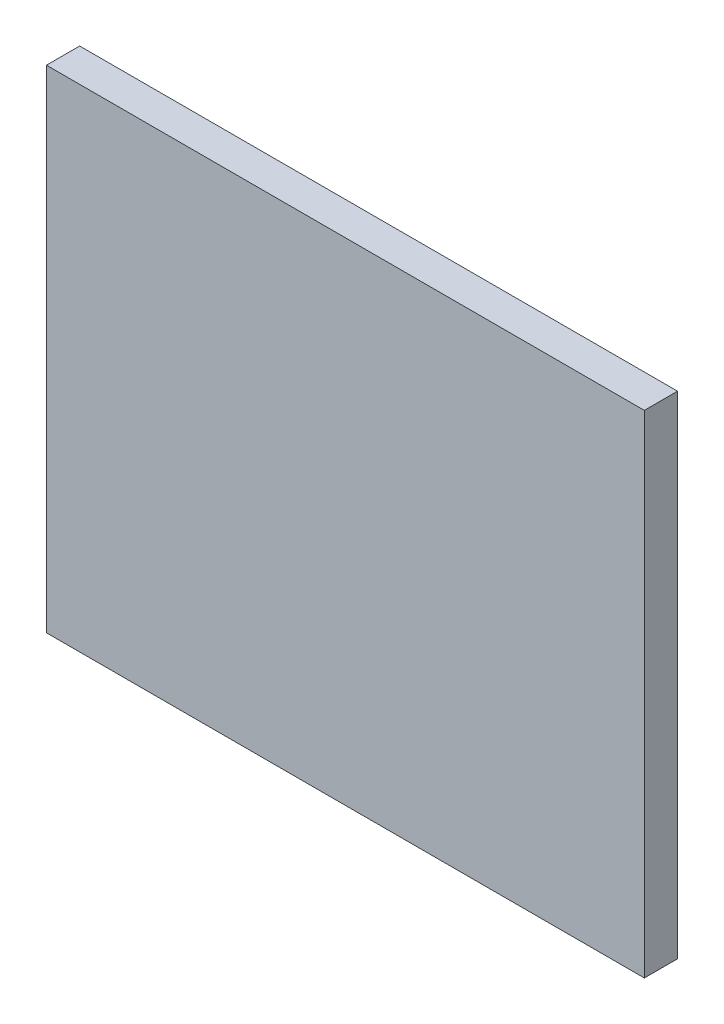
ISO-10303-21;
HEADER;
FILE_DESCRIPTION(('STEP AP214'),'2;1');
FILE_NAME('part.step','',(''),(''),'','','');
FILE_SCHEMA(('AUTOMOTIVE_DESIGN { 1 0 10303 214 1 1 1 1 }'));
ENDSEC;
DATA;
#1=APPLICATION_CONTEXT('core data for automotive mechanical design processes');
#2=APPLICATION_PROTOCOL_DEFINITION('international standard','automotive_design',2000,#1);
#3=PRODUCT_CONTEXT('',#1,'mechanical');
#4=PRODUCT('Part','Part','',(#3));
#5=PRODUCT_RELATED_PRODUCT_CATEGORY('part','',(#4));
#6=PRODUCT_DEFINITION_FORMATION('','',#4);
#7=PRODUCT_DEFINITION_CONTEXT('part definition',#1,'design');
#8=PRODUCT_DEFINITION('design','',#6,#7);
#9=PRODUCT_DEFINITION_SHAPE('','',#8);
#10=(LENGTH_UNIT() NAMED_UNIT(*) SI_UNIT(.MILLI.,.METRE.));
#11=(NAMED_UNIT(*) PLANE_ANGLE_UNIT() SI_UNIT($,.RADIAN.));
#12=(NAMED_UNIT(*) SI_UNIT($,.STERADIAN.) SOLID_ANGLE_UNIT());
#13=UNCERTAINTY_MEASURE_WITH_UNIT(LENGTH_MEASURE(1.E-05),#10,'distance_accuracy_value','');
#14=(GEOMETRIC_REPRESENTATION_CONTEXT(3) GLOBAL_UNCERTAINTY_ASSIGNED_CONTEXT((#13)) GLOBAL_UNIT_ASSIGNED_CONTEXT((#10,
#11,#12)) REPRESENTATION_CONTEXT('',''));
#15=CARTESIAN_POINT('',(0.,0.,0.));
#16=DIRECTION('',(0.,0.,1.));
#17=DIRECTION('',(1.,0.,0.));
#18=AXIS2_PLACEMENT_3D('',#15,#16,#17);
#19=CARTESIAN_POINT('',(0.,0.,0.));
#20=DIRECTION('',(0.,0.,-1.));
#21=DIRECTION('',(-1.,0.,0.));
#22=AXIS2_PLACEMENT_3D('',#19,#20,#21);
#23=PLANE('',#22);
#24=DIRECTION('',(0.,1.,0.));
#25=VECTOR('',#24,1.);
#26=CARTESIAN_POINT('',(45.,-37.,0.));
#27=LINE('',#26,#25);
#28=CARTESIAN_POINT('',(45.,-37.,0.));
#29=VERTEX_POINT('',#28);
#30=CARTESIAN_POINT('',(45.,37.,0.));
#31=VERTEX_POINT('',#30);
#32=EDGE_CURVE('E286',#29,#31,#27,.T.);
#33=ORIENTED_EDGE('',*,*,#32,.F.);
#34=DIRECTION('',(1.,0.,0.));
#35=VECTOR('',#34,1.);
#36=CARTESIAN_POINT('',(-45.,-37.,0.));
#37=LINE('',#36,#35);
#38=CARTESIAN_POINT('',(-45.,-37.,0.));
#39=VERTEX_POINT('',#38);
#40=EDGE_CURVE('E291',#39,#29,#37,.T.);
#41=ORIENTED_EDGE('',*,*,#40,.F.);
#42=DIRECTION('',(0.,-1.,0.));
#43=VECTOR('',#42,1.);
#44=CARTESIAN_POINT('',(-45.,-37.,0.));
#45=LINE('',#44,#43);
#46=CARTESIAN_POINT('',(-45.,37.,0.));
#47=VERTEX_POINT('',#46);
#48=EDGE_CURVE('E302',#47,#39,#45,.T.);
#49=ORIENTED_EDGE('',*,*,#48,.F.);
#50=DIRECTION('',(-1.,0.,0.));
#51=VECTOR('',#50,1.);
#52=CARTESIAN_POINT('',(-45.,37.,0.));
#53=LINE('',#52,#51);
#54=EDGE_CURVE('E300',#31,#47,#53,.T.);
#55=ORIENTED_EDGE('',*,*,#54,.F.);
#56=EDGE_LOOP('',(#33,#41,#49,#55));
#57=FACE_BOUND('',#56,.T.);
#58=DIRECTION('',(1.,0.,0.));
#59=VECTOR('',#58,1.);
#60=CARTESIAN_POINT('',(40.,32.5,0.));
#61=LINE('',#60,#59);
#62=CARTESIAN_POINT('',(10.,32.5,0.));
#63=VERTEX_POINT('',#62);
#64=CARTESIAN_POINT('',(40.,32.5,0.));
#65=VERTEX_POINT('',#64);
#66=EDGE_CURVE('E271',#63,#65,#61,.T.);
#67=ORIENTED_EDGE('',*,*,#66,.F.);
#68=DIRECTION('',(0.,1.,0.));
#69=VECTOR('',#68,1.);
#70=CARTESIAN_POINT('',(10.,32.5,0.));
#71=LINE('',#70,#69);
#72=CARTESIAN_POINT('',(10.,7.49999999999999,0.));
#73=VERTEX_POINT('',#72);
#74=EDGE_CURVE('E257',#73,#63,#71,.T.);
#75=ORIENTED_EDGE('',*,*,#74,.F.);
#76=DIRECTION('',(-1.,0.,0.));
#77=VECTOR('',#76,1.);
#78=CARTESIAN_POINT('',(40.,7.49999999999999,0.));
#79=LINE('',#78,#77);
#80=CARTESIAN_POINT('',(40.,7.49999999999999,0.));
#81=VERTEX_POINT('',#80);
#82=EDGE_CURVE('E262',#81,#73,#79,.T.);
#83=ORIENTED_EDGE('',*,*,#82,.F.);
#84=DIRECTION('',(0.,-1.,0.));
#85=VECTOR('',#84,1.);
#86=CARTESIAN_POINT('',(40.,32.5,0.));
#87=LINE('',#86,#85);
#88=EDGE_CURVE('E273',#65,#81,#87,.T.);
#89=ORIENTED_EDGE('',*,*,#88,.F.);
#90=EDGE_LOOP('',(#67,#75,#83,#89));
#91=FACE_BOUND('',#90,.T.);
#92=DIRECTION('',(-1.,0.,0.));
#93=VECTOR('',#92,1.);
#94=CARTESIAN_POINT('',(40.,-32.5,0.));
#95=LINE('',#94,#93);
#96=CARTESIAN_POINT('',(40.,-32.5,0.));
#97=VERTEX_POINT('',#96);
#98=CARTESIAN_POINT('',(10.,-32.5,0.));
#99=VERTEX_POINT('',#98);
#100=EDGE_CURVE('E242',#97,#99,#95,.T.);
#101=ORIENTED_EDGE('',*,*,#100,.F.);
#102=DIRECTION('',(0.,-1.,0.));
#103=VECTOR('',#102,1.);
#104=CARTESIAN_POINT('',(40.,-32.5,0.));
#105=LINE('',#104,#103);
#106=CARTESIAN_POINT('',(40.,-7.5,0.));
#107=VERTEX_POINT('',#106);
#108=EDGE_CURVE('E228',#107,#97,#105,.T.);
#109=ORIENTED_EDGE('',*,*,#108,.F.);
#110=DIRECTION('',(1.,0.,0.));
#111=VECTOR('',#110,1.);
#112=CARTESIAN_POINT('',(40.,-7.5,0.));
#113=LINE('',#112,#111);
#114=CARTESIAN_POINT('',(10.,-7.50000000000001,0.));
#115=VERTEX_POINT('',#114);
#116=EDGE_CURVE('E233',#115,#107,#113,.T.);
#117=ORIENTED_EDGE('',*,*,#116,.F.);
#118=DIRECTION('',(0.,1.,0.));
#119=VECTOR('',#118,1.);
#120=CARTESIAN_POINT('',(10.,-32.5,0.));
#121=LINE('',#120,#119);
#122=EDGE_CURVE('E244',#99,#115,#121,.T.);
#123=ORIENTED_EDGE('',*,*,#122,.F.);
#124=EDGE_LOOP('',(#101,#109,#117,#123));
#125=FACE_BOUND('',#124,.T.);
#126=DIRECTION('',(1.,0.,0.));
#127=VECTOR('',#126,1.);
#128=CARTESIAN_POINT('',(-40.,32.5,0.));
#129=LINE('',#128,#127);
#130=CARTESIAN_POINT('',(-40.,32.5,0.));
#131=VERTEX_POINT('',#130);
#132=CARTESIAN_POINT('',(-10.,32.5,0.));
#133=VERTEX_POINT('',#132);
#134=EDGE_CURVE('E200',#131,#133,#129,.T.);
#135=ORIENTED_EDGE('',*,*,#134,.F.);
#136=DIRECTION('',(0.,1.,0.));
#137=VECTOR('',#136,1.);
#138=CARTESIAN_POINT('',(-40.,32.5,0.));
#139=LINE('',#138,#137);
#140=CARTESIAN_POINT('',(-40.,7.50000000000002,0.));
#141=VERTEX_POINT('',#140);
#142=EDGE_CURVE('E197',#141,#131,#139,.T.);
#143=ORIENTED_EDGE('',*,*,#142,.F.);
#144=DIRECTION('',(-1.,0.,0.));
#145=VECTOR('',#144,1.);
#146=CARTESIAN_POINT('',(-40.,7.50000000000002,0.));
#147=LINE('',#146,#145);
#148=CARTESIAN_POINT('',(-10.,7.5,0.));
#149=VERTEX_POINT('',#148);
#150=EDGE_CURVE('E209',#149,#141,#147,.T.);
#151=ORIENTED_EDGE('',*,*,#150,.F.);
#152=DIRECTION('',(0.,-1.,0.));
#153=VECTOR('',#152,1.);
#154=CARTESIAN_POINT('',(-10.,32.5,0.));
#155=LINE('',#154,#153);
#156=EDGE_CURVE('E217',#133,#149,#155,.T.);
#157=ORIENTED_EDGE('',*,*,#156,.F.);
#158=EDGE_LOOP('',(#135,#143,#151,#157));
#159=FACE_BOUND('',#158,.T.);
#160=DIRECTION('',(0.,1.,0.));
#161=VECTOR('',#160,1.);
#162=CARTESIAN_POINT('',(-40.0000000000001,-32.5,0.));
#163=LINE('',#162,#161);
#164=CARTESIAN_POINT('',(-40.0000000000001,-32.5,0.));
#165=VERTEX_POINT('',#164);
#166=CARTESIAN_POINT('',(-40.,-7.49999999999997,0.));
#167=VERTEX_POINT('',#166);
#168=EDGE_CURVE('E576',#165,#167,#163,.T.);
#169=ORIENTED_EDGE('',*,*,#168,.F.);
#170=DIRECTION('',(-1.,0.,0.));
#171=VECTOR('',#170,1.);
#172=CARTESIAN_POINT('',(-40.0000000000001,-32.5,0.));
#173=LINE('',#172,#171);
#174=CARTESIAN_POINT('',(-10.0000000000001,-32.5,0.));
#175=VERTEX_POINT('',#174);
#176=EDGE_CURVE('E195',#175,#165,#173,.T.);
#177=ORIENTED_EDGE('',*,*,#176,.F.);
#178=DIRECTION('',(0.,-1.,0.));
#179=VECTOR('',#178,1.);
#180=CARTESIAN_POINT('',(-10.0000000000001,-32.5,0.));
#181=LINE('',#180,#179);
#182=CARTESIAN_POINT('',(-10.0000000000001,-7.49999999999999,0.));
#183=VERTEX_POINT('',#182);
#184=EDGE_CURVE('E191',#183,#175,#181,.T.);
#185=ORIENTED_EDGE('',*,*,#184,.F.);
#186=DIRECTION('',(1.,0.,0.));
#187=VECTOR('',#186,1.);
#188=CARTESIAN_POINT('',(-40.,-7.49999999999997,0.));
#189=LINE('',#188,#187);
#190=EDGE_CURVE('E573',#167,#183,#189,.T.);
#191=ORIENTED_EDGE('',*,*,#190,.F.);
#192=EDGE_LOOP('',(#169,#177,#185,#191));
#193=FACE_BOUND('',#192,.T.);
#194=ADVANCED_FACE('F34',(#57,#91,#125,#159,#193),#23,.T.);
#195=CARTESIAN_POINT('',(45.,-37.,5.));
#196=DIRECTION('',(-1.,0.,0.));
#197=DIRECTION('',(0.,0.,1.));
#198=AXIS2_PLACEMENT_3D('',#195,#196,#197);
#199=PLANE('',#198);
#200=ORIENTED_EDGE('',*,*,#32,.T.);
#201=DIRECTION('',(0.,0.,-1.));
#202=VECTOR('',#201,1.);
#203=CARTESIAN_POINT('',(45.,37.,5.));
#204=LINE('',#203,#202);
#205=CARTESIAN_POINT('',(45.,37.,5.));
#206=VERTEX_POINT('',#205);
#207=EDGE_CURVE('E11',#206,#31,#204,.T.);
#208=ORIENTED_EDGE('',*,*,#207,.F.);
#209=DIRECTION('',(0.,1.,0.));
#210=VECTOR('',#209,1.);
#211=CARTESIAN_POINT('',(45.,-37.,5.));
#212=LINE('',#211,#210);
#213=CARTESIAN_POINT('',(45.,-37.,5.));
#214=VERTEX_POINT('',#213);
#215=EDGE_CURVE('E287',#214,#206,#212,.T.);
#216=ORIENTED_EDGE('',*,*,#215,.F.);
#217=DIRECTION('',(0.,0.,-1.));
#218=VECTOR('',#217,1.);
#219=CARTESIAN_POINT('',(45.,-37.,5.));
#220=LINE('',#219,#218);
#221=EDGE_CURVE('E297',#214,#29,#220,.T.);
#222=ORIENTED_EDGE('',*,*,#221,.T.);
#223=EDGE_LOOP('',(#200,#208,#216,#222));
#224=FACE_BOUND('',#223,.T.);
#225=ADVANCED_FACE('F36',(#224),#199,.F.);
#226=CARTESIAN_POINT('',(-45.,37.,5.));
#227=DIRECTION('',(0.,-1.,0.));
#228=DIRECTION('',(0.,0.,-1.));
#229=AXIS2_PLACEMENT_3D('',#226,#227,#228);
#230=PLANE('',#229);
#231=ORIENTED_EDGE('',*,*,#54,.T.);
#232=DIRECTION('',(0.,0.,-1.));
#233=VECTOR('',#232,1.);
#234=CARTESIAN_POINT('',(-45.,37.,5.));
#235=LINE('',#234,#233);
#236=CARTESIAN_POINT('',(-45.,37.,5.));
#237=VERTEX_POINT('',#236);
#238=EDGE_CURVE('E42',#237,#47,#235,.T.);
#239=ORIENTED_EDGE('',*,*,#238,.F.);
#240=DIRECTION('',(-1.,0.,0.));
#241=VECTOR('',#240,1.);
#242=CARTESIAN_POINT('',(-45.,37.,5.));
#243=LINE('',#242,#241);
#244=EDGE_CURVE('E290',#206,#237,#243,.T.);
#245=ORIENTED_EDGE('',*,*,#244,.F.);
#246=ORIENTED_EDGE('',*,*,#207,.T.);
#247=EDGE_LOOP('',(#231,#239,#245,#246));
#248=FACE_BOUND('',#247,.T.);
#249=ADVANCED_FACE('F330',(#248),#230,.F.);
#250=CARTESIAN_POINT('',(-45.,-37.,5.));
#251=DIRECTION('',(1.,0.,0.));
#252=DIRECTION('',(0.,0.,-1.));
#253=AXIS2_PLACEMENT_3D('',#250,#251,#252);
#254=PLANE('',#253);
#255=ORIENTED_EDGE('',*,*,#48,.T.);
#256=DIRECTION('',(0.,0.,-1.));
#257=VECTOR('',#256,1.);
#258=CARTESIAN_POINT('',(-45.,-37.,5.));
#259=LINE('',#258,#257);
#260=CARTESIAN_POINT('',(-45.,-37.,5.));
#261=VERTEX_POINT('',#260);
#262=EDGE_CURVE('E307',#261,#39,#259,.T.);
#263=ORIENTED_EDGE('',*,*,#262,.F.);
#264=DIRECTION('',(0.,-1.,0.));
#265=VECTOR('',#264,1.);
#266=CARTESIAN_POINT('',(-45.,-37.,5.));
#267=LINE('',#266,#265);
#268=EDGE_CURVE('E293',#237,#261,#267,.T.);
#269=ORIENTED_EDGE('',*,*,#268,.F.);
#270=ORIENTED_EDGE('',*,*,#238,.T.);
#271=EDGE_LOOP('',(#255,#263,#269,#270));
#272=FACE_BOUND('',#271,.T.);
#273=ADVANCED_FACE('F314',(#272),#254,.F.);
#274=CARTESIAN_POINT('',(-45.,-37.,5.));
#275=DIRECTION('',(0.,1.,0.));
#276=DIRECTION('',(0.,0.,1.));
#277=AXIS2_PLACEMENT_3D('',#274,#275,#276);
#278=PLANE('',#277);
#279=ORIENTED_EDGE('',*,*,#40,.T.);
#280=ORIENTED_EDGE('',*,*,#221,.F.);
#281=DIRECTION('',(1.,0.,0.));
#282=VECTOR('',#281,1.);
#283=CARTESIAN_POINT('',(-45.,-37.,5.));
#284=LINE('',#283,#282);
#285=EDGE_CURVE('E295',#261,#214,#284,.T.);
#286=ORIENTED_EDGE('',*,*,#285,.F.);
#287=ORIENTED_EDGE('',*,*,#262,.T.);
#288=EDGE_LOOP('',(#279,#280,#286,#287));
#289=FACE_BOUND('',#288,.T.);
#290=ADVANCED_FACE('F323',(#289),#278,.F.);
#291=CARTESIAN_POINT('',(0.,0.,5.));
#292=DIRECTION('',(0.,0.,-1.));
#293=DIRECTION('',(-1.,0.,0.));
#294=AXIS2_PLACEMENT_3D('',#291,#292,#293);
#295=PLANE('',#294);
#296=ORIENTED_EDGE('',*,*,#215,.T.);
#297=ORIENTED_EDGE('',*,*,#244,.T.);
#298=ORIENTED_EDGE('',*,*,#268,.T.);
#299=ORIENTED_EDGE('',*,*,#285,.T.);
#300=EDGE_LOOP('',(#296,#297,#298,#299));
#301=FACE_BOUND('',#300,.T.);
#302=ADVANCED_FACE('F329',(#301),#295,.F.);
#303=CARTESIAN_POINT('',(10.,32.5,-1.));
#304=DIRECTION('',(1.,0.,0.));
#305=DIRECTION('',(0.,1.,0.));
#306=AXIS2_PLACEMENT_3D('',#303,#304,#305);
#307=PLANE('',#306);
#308=ORIENTED_EDGE('',*,*,#74,.T.);
#309=DIRECTION('',(0.,0.,1.));
#310=VECTOR('',#309,1.);
#311=CARTESIAN_POINT('',(10.,32.5,-1.));
#312=LINE('',#311,#310);
#313=CARTESIAN_POINT('',(10.,32.5,-1.));
#314=VERTEX_POINT('',#313);
#315=EDGE_CURVE('E284',#314,#63,#312,.T.);
#316=ORIENTED_EDGE('',*,*,#315,.F.);
#317=DIRECTION('',(0.,1.,0.));
#318=VECTOR('',#317,1.);
#319=CARTESIAN_POINT('',(10.,32.5,-1.));
#320=LINE('',#319,#318);
#321=CARTESIAN_POINT('',(10.,7.49999999999999,-1.));
#322=VERTEX_POINT('',#321);
#323=EDGE_CURVE('E258',#322,#314,#320,.T.);
#324=ORIENTED_EDGE('',*,*,#323,.F.);
#325=DIRECTION('',(0.,0.,1.));
#326=VECTOR('',#325,1.);
#327=CARTESIAN_POINT('',(10.,7.49999999999999,-1.));
#328=LINE('',#327,#326);
#329=EDGE_CURVE('E268',#322,#73,#328,.T.);
#330=ORIENTED_EDGE('',*,*,#329,.T.);
#331=EDGE_LOOP('',(#308,#316,#324,#330));
#332=FACE_BOUND('',#331,.T.);
#333=ADVANCED_FACE('F348',(#332),#307,.F.);
#334=CARTESIAN_POINT('',(40.,32.5,-1.));
#335=DIRECTION('',(0.,-1.,0.));
#336=DIRECTION('',(1.,0.,0.));
#337=AXIS2_PLACEMENT_3D('',#334,#335,#336);
#338=PLANE('',#337);
#339=ORIENTED_EDGE('',*,*,#66,.T.);
#340=DIRECTION('',(0.,0.,1.));
#341=VECTOR('',#340,1.);
#342=CARTESIAN_POINT('',(40.,32.5,-1.));
#343=LINE('',#342,#341);
#344=CARTESIAN_POINT('',(40.,32.5,-1.));
#345=VERTEX_POINT('',#344);
#346=EDGE_CURVE('E281',#345,#65,#343,.T.);
#347=ORIENTED_EDGE('',*,*,#346,.F.);
#348=DIRECTION('',(1.,0.,0.));
#349=VECTOR('',#348,1.);
#350=CARTESIAN_POINT('',(40.,32.5,-1.));
#351=LINE('',#350,#349);
#352=EDGE_CURVE('E261',#314,#345,#351,.T.);
#353=ORIENTED_EDGE('',*,*,#352,.F.);
#354=ORIENTED_EDGE('',*,*,#315,.T.);
#355=EDGE_LOOP('',(#339,#347,#353,#354));
#356=FACE_BOUND('',#355,.T.);
#357=ADVANCED_FACE('F352',(#356),#338,.F.);
#358=CARTESIAN_POINT('',(40.,32.5,-1.));
#359=DIRECTION('',(-1.,0.,0.));
#360=DIRECTION('',(0.,0.,1.));
#361=AXIS2_PLACEMENT_3D('',#358,#359,#360);
#362=PLANE('',#361);
#363=ORIENTED_EDGE('',*,*,#88,.T.);
#364=DIRECTION('',(0.,0.,1.));
#365=VECTOR('',#364,1.);
#366=CARTESIAN_POINT('',(40.,7.49999999999999,-1.));
#367=LINE('',#366,#365);
#368=CARTESIAN_POINT('',(40.,7.49999999999999,-1.));
#369=VERTEX_POINT('',#368);
#370=EDGE_CURVE('E279',#369,#81,#367,.T.);
#371=ORIENTED_EDGE('',*,*,#370,.F.);
#372=DIRECTION('',(0.,-1.,0.));
#373=VECTOR('',#372,1.);
#374=CARTESIAN_POINT('',(40.,32.5,-1.));
#375=LINE('',#374,#373);
#376=EDGE_CURVE('E264',#345,#369,#375,.T.);
#377=ORIENTED_EDGE('',*,*,#376,.F.);
#378=ORIENTED_EDGE('',*,*,#346,.T.);
#379=EDGE_LOOP('',(#363,#371,#377,#378));
#380=FACE_BOUND('',#379,.T.);
#381=ADVANCED_FACE('F357',(#380),#362,.F.);
#382=CARTESIAN_POINT('',(40.,7.49999999999999,-1.));
#383=DIRECTION('',(0.,1.,0.));
#384=DIRECTION('',(-1.,0.,0.));
#385=AXIS2_PLACEMENT_3D('',#382,#383,#384);
#386=PLANE('',#385);
#387=ORIENTED_EDGE('',*,*,#82,.T.);
#388=ORIENTED_EDGE('',*,*,#329,.F.);
#389=DIRECTION('',(-1.,0.,0.));
#390=VECTOR('',#389,1.);
#391=CARTESIAN_POINT('',(40.,7.49999999999999,-1.));
#392=LINE('',#391,#390);
#393=EDGE_CURVE('E266',#369,#322,#392,.T.);
#394=ORIENTED_EDGE('',*,*,#393,.F.);
#395=ORIENTED_EDGE('',*,*,#370,.T.);
#396=EDGE_LOOP('',(#387,#388,#394,#395));
#397=FACE_BOUND('',#396,.T.);
#398=ADVANCED_FACE('F363',(#397),#386,.F.);
#399=CARTESIAN_POINT('',(0.,0.,-1.));
#400=DIRECTION('',(0.,0.,-1.));
#401=DIRECTION('',(-1.,0.,0.));
#402=AXIS2_PLACEMENT_3D('',#399,#400,#401);
#403=PLANE('',#402);
#404=ORIENTED_EDGE('',*,*,#323,.T.);
#405=ORIENTED_EDGE('',*,*,#352,.T.);
#406=ORIENTED_EDGE('',*,*,#376,.T.);
#407=ORIENTED_EDGE('',*,*,#393,.T.);
#408=EDGE_LOOP('',(#404,#405,#406,#407));
#409=FACE_BOUND('',#408,.T.);
#410=ADVANCED_FACE('F367',(#409),#403,.T.);
#411=CARTESIAN_POINT('',(40.,-32.5,-1.));
#412=DIRECTION('',(-1.,0.,0.));
#413=DIRECTION('',(0.,0.,1.));
#414=AXIS2_PLACEMENT_3D('',#411,#412,#413);
#415=PLANE('',#414);
#416=ORIENTED_EDGE('',*,*,#108,.T.);
#417=DIRECTION('',(0.,0.,1.));
#418=VECTOR('',#417,1.);
#419=CARTESIAN_POINT('',(40.,-32.5,-1.));
#420=LINE('',#419,#418);
#421=CARTESIAN_POINT('',(40.,-32.5,-1.));
#422=VERTEX_POINT('',#421);
#423=EDGE_CURVE('E255',#422,#97,#420,.T.);
#424=ORIENTED_EDGE('',*,*,#423,.F.);
#425=DIRECTION('',(0.,-1.,0.));
#426=VECTOR('',#425,1.);
#427=CARTESIAN_POINT('',(40.,-32.5,-1.));
#428=LINE('',#427,#426);
#429=CARTESIAN_POINT('',(40.,-7.5,-1.));
#430=VERTEX_POINT('',#429);
#431=EDGE_CURVE('E229',#430,#422,#428,.T.);
#432=ORIENTED_EDGE('',*,*,#431,.F.);
#433=DIRECTION('',(0.,0.,1.));
#434=VECTOR('',#433,1.);
#435=CARTESIAN_POINT('',(40.,-7.5,-1.));
#436=LINE('',#435,#434);
#437=EDGE_CURVE('E239',#430,#107,#436,.T.);
#438=ORIENTED_EDGE('',*,*,#437,.T.);
#439=EDGE_LOOP('',(#416,#424,#432,#438));
#440=FACE_BOUND('',#439,.T.);
#441=ADVANCED_FACE('F371',(#440),#415,.F.);
#442=CARTESIAN_POINT('',(40.,-32.5,-1.));
#443=DIRECTION('',(0.,1.,0.));
#444=DIRECTION('',(-1.,0.,0.));
#445=AXIS2_PLACEMENT_3D('',#442,#443,#444);
#446=PLANE('',#445);
#447=ORIENTED_EDGE('',*,*,#100,.T.);
#448=DIRECTION('',(0.,0.,1.));
#449=VECTOR('',#448,1.);
#450=CARTESIAN_POINT('',(10.,-32.5,-1.));
#451=LINE('',#450,#449);
#452=CARTESIAN_POINT('',(10.,-32.5,-1.));
#453=VERTEX_POINT('',#452);
#454=EDGE_CURVE('E252',#453,#99,#451,.T.);
#455=ORIENTED_EDGE('',*,*,#454,.F.);
#456=DIRECTION('',(-1.,0.,0.));
#457=VECTOR('',#456,1.);
#458=CARTESIAN_POINT('',(40.,-32.5,-1.));
#459=LINE('',#458,#457);
#460=EDGE_CURVE('E232',#422,#453,#459,.T.);
#461=ORIENTED_EDGE('',*,*,#460,.F.);
#462=ORIENTED_EDGE('',*,*,#423,.T.);
#463=EDGE_LOOP('',(#447,#455,#461,#462));
#464=FACE_BOUND('',#463,.T.);
#465=ADVANCED_FACE('F375',(#464),#446,.F.);
#466=CARTESIAN_POINT('',(10.,-32.5,-1.));
#467=DIRECTION('',(1.,0.,0.));
#468=DIRECTION('',(0.,1.,0.));
#469=AXIS2_PLACEMENT_3D('',#466,#467,#468);
#470=PLANE('',#469);
#471=ORIENTED_EDGE('',*,*,#122,.T.);
#472=DIRECTION('',(0.,0.,1.));
#473=VECTOR('',#472,1.);
#474=CARTESIAN_POINT('',(10.,-7.50000000000001,-1.));
#475=LINE('',#474,#473);
#476=CARTESIAN_POINT('',(10.,-7.50000000000001,-1.));
#477=VERTEX_POINT('',#476);
#478=EDGE_CURVE('E250',#477,#115,#475,.T.);
#479=ORIENTED_EDGE('',*,*,#478,.F.);
#480=DIRECTION('',(0.,1.,0.));
#481=VECTOR('',#480,1.);
#482=CARTESIAN_POINT('',(10.,-32.5,-1.));
#483=LINE('',#482,#481);
#484=EDGE_CURVE('E235',#453,#477,#483,.T.);
#485=ORIENTED_EDGE('',*,*,#484,.F.);
#486=ORIENTED_EDGE('',*,*,#454,.T.);
#487=EDGE_LOOP('',(#471,#479,#485,#486));
#488=FACE_BOUND('',#487,.T.);
#489=ADVANCED_FACE('F379',(#488),#470,.F.);
#490=CARTESIAN_POINT('',(40.,-7.5,-1.));
#491=DIRECTION('',(0.,-1.,0.));
#492=DIRECTION('',(1.,0.,0.));
#493=AXIS2_PLACEMENT_3D('',#490,#491,#492);
#494=PLANE('',#493);
#495=ORIENTED_EDGE('',*,*,#116,.T.);
#496=ORIENTED_EDGE('',*,*,#437,.F.);
#497=DIRECTION('',(1.,0.,0.));
#498=VECTOR('',#497,1.);
#499=CARTESIAN_POINT('',(40.,-7.5,-1.));
#500=LINE('',#499,#498);
#501=EDGE_CURVE('E237',#477,#430,#500,.T.);
#502=ORIENTED_EDGE('',*,*,#501,.F.);
#503=ORIENTED_EDGE('',*,*,#478,.T.);
#504=EDGE_LOOP('',(#495,#496,#502,#503));
#505=FACE_BOUND('',#504,.T.);
#506=ADVANCED_FACE('F383',(#505),#494,.F.);
#507=CARTESIAN_POINT('',(0.,0.,-1.));
#508=DIRECTION('',(0.,0.,1.));
#509=DIRECTION('',(1.,0.,0.));
#510=AXIS2_PLACEMENT_3D('',#507,#508,#509);
#511=PLANE('',#510);
#512=ORIENTED_EDGE('',*,*,#431,.T.);
#513=ORIENTED_EDGE('',*,*,#460,.T.);
#514=ORIENTED_EDGE('',*,*,#484,.T.);
#515=ORIENTED_EDGE('',*,*,#501,.T.);
#516=EDGE_LOOP('',(#512,#513,#514,#515));
#517=FACE_BOUND('',#516,.T.);
#518=ADVANCED_FACE('F387',(#517),#511,.F.);
#519=CARTESIAN_POINT('',(-40.,32.5,-1.));
#520=DIRECTION('',(1.,0.,0.));
#521=DIRECTION('',(0.,1.,0.));
#522=AXIS2_PLACEMENT_3D('',#519,#520,#521);
#523=PLANE('',#522);
#524=ORIENTED_EDGE('',*,*,#142,.T.);
#525=DIRECTION('',(0.,0.,1.));
#526=VECTOR('',#525,1.);
#527=CARTESIAN_POINT('',(-40.,32.5,-1.));
#528=LINE('',#527,#526);
#529=CARTESIAN_POINT('',(-40.,32.5,-1.));
#530=VERTEX_POINT('',#529);
#531=EDGE_CURVE('E226',#530,#131,#528,.T.);
#532=ORIENTED_EDGE('',*,*,#531,.F.);
#533=DIRECTION('',(0.,1.,0.));
#534=VECTOR('',#533,1.);
#535=CARTESIAN_POINT('',(-40.,32.5,-1.));
#536=LINE('',#535,#534);
#537=CARTESIAN_POINT('',(-40.,7.50000000000002,-1.));
#538=VERTEX_POINT('',#537);
#539=EDGE_CURVE('E205',#538,#530,#536,.T.);
#540=ORIENTED_EDGE('',*,*,#539,.F.);
#541=DIRECTION('',(0.,0.,1.));
#542=VECTOR('',#541,1.);
#543=CARTESIAN_POINT('',(-40.,7.50000000000002,-1.));
#544=LINE('',#543,#542);
#545=EDGE_CURVE('E214',#538,#141,#544,.T.);
#546=ORIENTED_EDGE('',*,*,#545,.T.);
#547=EDGE_LOOP('',(#524,#532,#540,#546));
#548=FACE_BOUND('',#547,.T.);
#549=ADVANCED_FACE('F391',(#548),#523,.F.);
#550=CARTESIAN_POINT('',(-40.,32.5,-1.));
#551=DIRECTION('',(0.,-1.,0.));
#552=DIRECTION('',(1.,0.,0.));
#553=AXIS2_PLACEMENT_3D('',#550,#551,#552);
#554=PLANE('',#553);
#555=ORIENTED_EDGE('',*,*,#134,.T.);
#556=DIRECTION('',(0.,0.,1.));
#557=VECTOR('',#556,1.);
#558=CARTESIAN_POINT('',(-10.,32.5,-1.));
#559=LINE('',#558,#557);
#560=CARTESIAN_POINT('',(-10.,32.5,-1.));
#561=VERTEX_POINT('',#560);
#562=EDGE_CURVE('E223',#561,#133,#559,.T.);
#563=ORIENTED_EDGE('',*,*,#562,.F.);
#564=DIRECTION('',(1.,0.,0.));
#565=VECTOR('',#564,1.);
#566=CARTESIAN_POINT('',(-40.,32.5,-1.));
#567=LINE('',#566,#565);
#568=EDGE_CURVE('E208',#530,#561,#567,.T.);
#569=ORIENTED_EDGE('',*,*,#568,.F.);
#570=ORIENTED_EDGE('',*,*,#531,.T.);
#571=EDGE_LOOP('',(#555,#563,#569,#570));
#572=FACE_BOUND('',#571,.T.);
#573=ADVANCED_FACE('F395',(#572),#554,.F.);
#574=CARTESIAN_POINT('',(-10.,32.5,-1.));
#575=DIRECTION('',(-1.,0.,0.));
#576=DIRECTION('',(0.,-1.,0.));
#577=AXIS2_PLACEMENT_3D('',#574,#575,#576);
#578=PLANE('',#577);
#579=ORIENTED_EDGE('',*,*,#156,.T.);
#580=DIRECTION('',(0.,0.,1.));
#581=VECTOR('',#580,1.);
#582=CARTESIAN_POINT('',(-10.,7.5,-1.));
#583=LINE('',#582,#581);
#584=CARTESIAN_POINT('',(-10.,7.5,-1.));
#585=VERTEX_POINT('',#584);
#586=EDGE_CURVE('E57',#585,#149,#583,.T.);
#587=ORIENTED_EDGE('',*,*,#586,.F.);
#588=DIRECTION('',(0.,-1.,0.));
#589=VECTOR('',#588,1.);
#590=CARTESIAN_POINT('',(-10.,32.5,-1.));
#591=LINE('',#590,#589);
#592=EDGE_CURVE('E211',#561,#585,#591,.T.);
#593=ORIENTED_EDGE('',*,*,#592,.F.);
#594=ORIENTED_EDGE('',*,*,#562,.T.);
#595=EDGE_LOOP('',(#579,#587,#593,#594));
#596=FACE_BOUND('',#595,.T.);
#597=ADVANCED_FACE('F399',(#596),#578,.F.);
#598=CARTESIAN_POINT('',(-40.,7.50000000000002,-1.));
#599=DIRECTION('',(0.,1.,0.));
#600=DIRECTION('',(-1.,0.,0.));
#601=AXIS2_PLACEMENT_3D('',#598,#599,#600);
#602=PLANE('',#601);
#603=ORIENTED_EDGE('',*,*,#150,.T.);
#604=ORIENTED_EDGE('',*,*,#545,.F.);
#605=DIRECTION('',(-1.,0.,0.));
#606=VECTOR('',#605,1.);
#607=CARTESIAN_POINT('',(-40.,7.50000000000002,-1.));
#608=LINE('',#607,#606);
#609=EDGE_CURVE('E213',#585,#538,#608,.T.);
#610=ORIENTED_EDGE('',*,*,#609,.F.);
#611=ORIENTED_EDGE('',*,*,#586,.T.);
#612=EDGE_LOOP('',(#603,#604,#610,#611));
#613=FACE_BOUND('',#612,.T.);
#614=ADVANCED_FACE('F403',(#613),#602,.F.);
#615=CARTESIAN_POINT('',(0.,0.,-1.));
#616=DIRECTION('',(0.,0.,1.));
#617=DIRECTION('',(1.,0.,0.));
#618=AXIS2_PLACEMENT_3D('',#615,#616,#617);
#619=PLANE('',#618);
#620=ORIENTED_EDGE('',*,*,#539,.T.);
#621=ORIENTED_EDGE('',*,*,#568,.T.);
#622=ORIENTED_EDGE('',*,*,#592,.T.);
#623=ORIENTED_EDGE('',*,*,#609,.T.);
#624=EDGE_LOOP('',(#620,#621,#622,#623));
#625=FACE_BOUND('',#624,.T.);
#626=ADVANCED_FACE('F407',(#625),#619,.F.);
#627=CARTESIAN_POINT('',(-40.0000000000001,-32.5,-1.));
#628=DIRECTION('',(0.,1.,0.));
#629=DIRECTION('',(-1.,0.,0.));
#630=AXIS2_PLACEMENT_3D('',#627,#628,#629);
#631=PLANE('',#630);
#632=ORIENTED_EDGE('',*,*,#176,.T.);
#633=DIRECTION('',(0.,0.,1.));
#634=VECTOR('',#633,1.);
#635=CARTESIAN_POINT('',(-40.0000000000001,-32.5,-1.));
#636=LINE('',#635,#634);
#637=CARTESIAN_POINT('',(-40.0000000000001,-32.5,-1.));
#638=VERTEX_POINT('',#637);
#639=EDGE_CURVE('E176',#638,#165,#636,.T.);
#640=ORIENTED_EDGE('',*,*,#639,.F.);
#641=DIRECTION('',(-1.,0.,0.));
#642=VECTOR('',#641,1.);
#643=CARTESIAN_POINT('',(-40.0000000000001,-32.5,-1.));
#644=LINE('',#643,#642);
#645=CARTESIAN_POINT('',(-10.0000000000001,-32.5,-1.));
#646=VERTEX_POINT('',#645);
#647=EDGE_CURVE('E183',#646,#638,#644,.T.);
#648=ORIENTED_EDGE('',*,*,#647,.F.);
#649=DIRECTION('',(0.,0.,1.));
#650=VECTOR('',#649,1.);
#651=CARTESIAN_POINT('',(-10.0000000000001,-32.5,-1.));
#652=LINE('',#651,#650);
#653=EDGE_CURVE('E570',#646,#175,#652,.T.);
#654=ORIENTED_EDGE('',*,*,#653,.T.);
#655=EDGE_LOOP('',(#632,#640,#648,#654));
#656=FACE_BOUND('',#655,.T.);
#657=ADVANCED_FACE('F193',(#656),#631,.F.);
#658=CARTESIAN_POINT('',(-40.0000000000001,-32.5,-1.));
#659=DIRECTION('',(1.,0.,0.));
#660=DIRECTION('',(0.,1.,0.));
#661=AXIS2_PLACEMENT_3D('',#658,#659,#660);
#662=PLANE('',#661);
#663=ORIENTED_EDGE('',*,*,#168,.T.);
#664=DIRECTION('',(0.,0.,1.));
#665=VECTOR('',#664,1.);
#666=CARTESIAN_POINT('',(-40.,-7.49999999999997,-1.));
#667=LINE('',#666,#665);
#668=CARTESIAN_POINT('',(-40.,-7.49999999999997,-1.));
#669=VERTEX_POINT('',#668);
#670=EDGE_CURVE('E179',#669,#167,#667,.T.);
#671=ORIENTED_EDGE('',*,*,#670,.F.);
#672=DIRECTION('',(0.,1.,0.));
#673=VECTOR('',#672,1.);
#674=CARTESIAN_POINT('',(-40.0000000000001,-32.5,-1.));
#675=LINE('',#674,#673);
#676=EDGE_CURVE('E172',#638,#669,#675,.T.);
#677=ORIENTED_EDGE('',*,*,#676,.F.);
#678=ORIENTED_EDGE('',*,*,#639,.T.);
#679=EDGE_LOOP('',(#663,#671,#677,#678));
#680=FACE_BOUND('',#679,.T.);
#681=ADVANCED_FACE('F174',(#680),#662,.F.);
#682=CARTESIAN_POINT('',(-40.,-7.49999999999997,-1.));
#683=DIRECTION('',(0.,-1.,0.));
#684=DIRECTION('',(1.,0.,0.));
#685=AXIS2_PLACEMENT_3D('',#682,#683,#684);
#686=PLANE('',#685);
#687=ORIENTED_EDGE('',*,*,#190,.T.);
#688=DIRECTION('',(0.,0.,1.));
#689=VECTOR('',#688,1.);
#690=CARTESIAN_POINT('',(-10.0000000000001,-7.49999999999999,-1.));
#691=LINE('',#690,#689);
#692=CARTESIAN_POINT('',(-10.0000000000001,-7.49999999999999,-1.));
#693=VERTEX_POINT('',#692);
#694=EDGE_CURVE('E49',#693,#183,#691,.T.);
#695=ORIENTED_EDGE('',*,*,#694,.F.);
#696=DIRECTION('',(1.,0.,0.));
#697=VECTOR('',#696,1.);
#698=CARTESIAN_POINT('',(-40.,-7.49999999999997,-1.));
#699=LINE('',#698,#697);
#700=EDGE_CURVE('E182',#669,#693,#699,.T.);
#701=ORIENTED_EDGE('',*,*,#700,.F.);
#702=ORIENTED_EDGE('',*,*,#670,.T.);
#703=EDGE_LOOP('',(#687,#695,#701,#702));
#704=FACE_BOUND('',#703,.T.);
#705=ADVANCED_FACE('F415',(#704),#686,.F.);
#706=CARTESIAN_POINT('',(-10.0000000000001,-32.5,-1.));
#707=DIRECTION('',(-1.,0.,0.));
#708=DIRECTION('',(0.,-1.,0.));
#709=AXIS2_PLACEMENT_3D('',#706,#707,#708);
#710=PLANE('',#709);
#711=ORIENTED_EDGE('',*,*,#184,.T.);
#712=ORIENTED_EDGE('',*,*,#653,.F.);
#713=DIRECTION('',(0.,-1.,0.));
#714=VECTOR('',#713,1.);
#715=CARTESIAN_POINT('',(-10.0000000000001,-32.5,-1.));
#716=LINE('',#715,#714);
#717=EDGE_CURVE('E187',#693,#646,#716,.T.);
#718=ORIENTED_EDGE('',*,*,#717,.F.);
#719=ORIENTED_EDGE('',*,*,#694,.T.);
#720=EDGE_LOOP('',(#711,#712,#718,#719));
#721=FACE_BOUND('',#720,.T.);
#722=ADVANCED_FACE('F418',(#721),#710,.F.);
#723=CARTESIAN_POINT('',(0.,0.,-1.));
#724=DIRECTION('',(0.,0.,1.));
#725=DIRECTION('',(1.,0.,0.));
#726=AXIS2_PLACEMENT_3D('',#723,#724,#725);
#727=PLANE('',#726);
#728=ORIENTED_EDGE('',*,*,#647,.T.);
#729=ORIENTED_EDGE('',*,*,#676,.T.);
#730=ORIENTED_EDGE('',*,*,#700,.T.);
#731=ORIENTED_EDGE('',*,*,#717,.T.);
#732=EDGE_LOOP('',(#728,#729,#730,#731));
#733=FACE_BOUND('',#732,.T.);
#734=ADVANCED_FACE('F186',(#733),#727,.F.);
#735=CLOSED_SHELL('',(#194,#225,#249,#273,#290,#302,#333,#357,#381,#398,#410,#441,#465,#489,
#506,#518,#549,#573,#597,#614,#626,#657,#681,#705,#722,#734));
#736=MANIFOLD_SOLID_BREP('B2',#735);
#737=ADVANCED_BREP_SHAPE_REPRESENTATION('',(#18,#736),#14);
#738=SHAPE_DEFINITION_REPRESENTATION(#9,#737);
ENDSEC;
END-ISO-10303-21;
